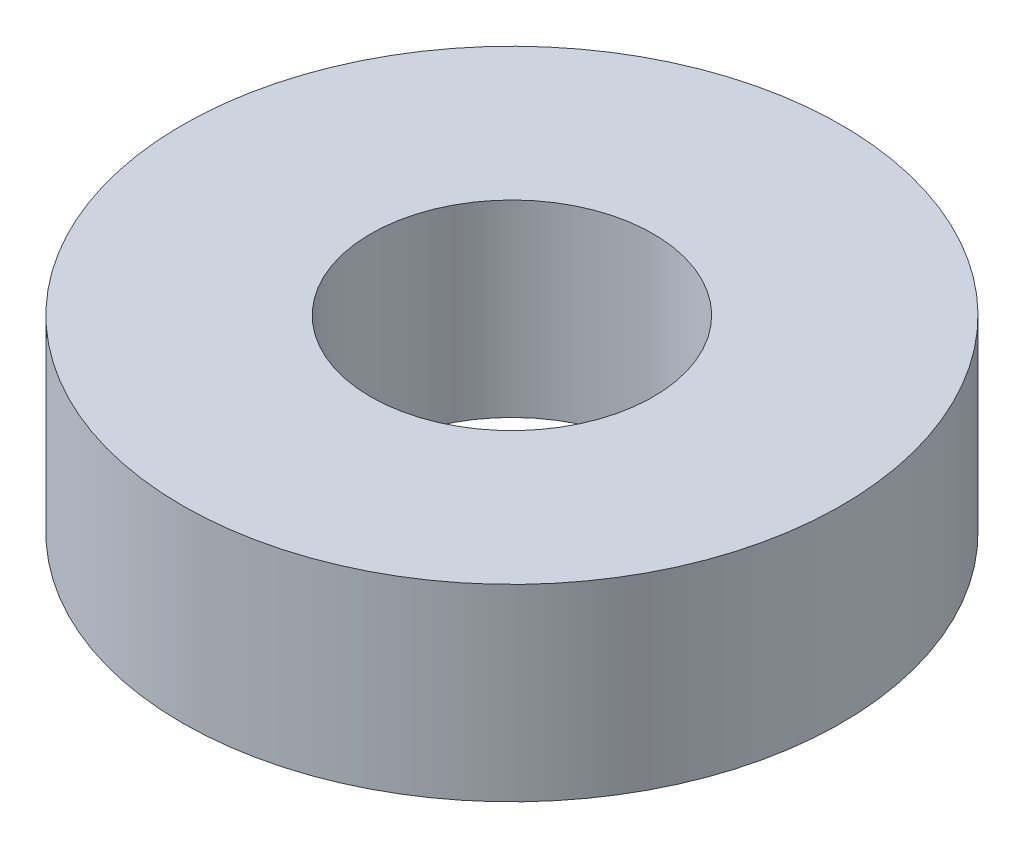
ISO-10303-21;
HEADER;
FILE_DESCRIPTION(('STEP AP214'),'2;1');
FILE_NAME('part.step','',(''),(''),'','','');
FILE_SCHEMA(('AUTOMOTIVE_DESIGN { 1 0 10303 214 1 1 1 1 }'));
ENDSEC;
DATA;
#1=APPLICATION_CONTEXT('core data for automotive mechanical design processes');
#2=APPLICATION_PROTOCOL_DEFINITION('international standard','automotive_design',2000,#1);
#3=PRODUCT_CONTEXT('',#1,'mechanical');
#4=PRODUCT('Part','Part','',(#3));
#5=PRODUCT_RELATED_PRODUCT_CATEGORY('part','',(#4));
#6=PRODUCT_DEFINITION_FORMATION('','',#4);
#7=PRODUCT_DEFINITION_CONTEXT('part definition',#1,'design');
#8=PRODUCT_DEFINITION('design','',#6,#7);
#9=PRODUCT_DEFINITION_SHAPE('','',#8);
#10=(LENGTH_UNIT() NAMED_UNIT(*) SI_UNIT(.MILLI.,.METRE.));
#11=(NAMED_UNIT(*) PLANE_ANGLE_UNIT() SI_UNIT($,.RADIAN.));
#12=(NAMED_UNIT(*) SI_UNIT($,.STERADIAN.) SOLID_ANGLE_UNIT());
#13=UNCERTAINTY_MEASURE_WITH_UNIT(LENGTH_MEASURE(1.E-05),#10,'distance_accuracy_value','');
#14=(GEOMETRIC_REPRESENTATION_CONTEXT(3) GLOBAL_UNCERTAINTY_ASSIGNED_CONTEXT((#13)) GLOBAL_UNIT_ASSIGNED_CONTEXT((#10,
#11,#12)) REPRESENTATION_CONTEXT('',''));
#15=CARTESIAN_POINT('',(0.,0.,0.));
#16=DIRECTION('',(0.,0.,1.));
#17=DIRECTION('',(1.,0.,0.));
#18=AXIS2_PLACEMENT_3D('',#15,#16,#17);
#19=CARTESIAN_POINT('',(0.,30.,0.));
#20=DIRECTION('',(0.,-1.,0.));
#21=DIRECTION('',(0.,0.,-1.));
#22=AXIS2_PLACEMENT_3D('',#19,#20,#21);
#23=CYLINDRICAL_SURFACE('',#22,52.5);
#24=CARTESIAN_POINT('',(0.,30.,0.));
#25=DIRECTION('',(0.,1.,0.));
#26=DIRECTION('',(0.,0.,1.));
#27=AXIS2_PLACEMENT_3D('',#24,#25,#26);
#28=CIRCLE('',#27,52.5);
#29=CARTESIAN_POINT('',(0.,30.,52.5));
#30=VERTEX_POINT('',#29);
#31=EDGE_CURVE('E10',#30,#30,#28,.T.);
#32=ORIENTED_EDGE('',*,*,#31,.F.);
#33=EDGE_LOOP('',(#32));
#34=FACE_BOUND('',#33,.T.);
#35=CARTESIAN_POINT('',(0.,0.,0.));
#36=DIRECTION('',(0.,1.,0.));
#37=DIRECTION('',(0.,0.,1.));
#38=AXIS2_PLACEMENT_3D('',#35,#36,#37);
#39=CIRCLE('',#38,52.5);
#40=CARTESIAN_POINT('',(0.,0.,52.5));
#41=VERTEX_POINT('',#40);
#42=EDGE_CURVE('E37',#41,#41,#39,.T.);
#43=ORIENTED_EDGE('',*,*,#42,.T.);
#44=EDGE_LOOP('',(#43));
#45=FACE_BOUND('',#44,.T.);
#46=ADVANCED_FACE('F40',(#34,#45),#23,.T.);
#47=CARTESIAN_POINT('',(0.,30.,0.));
#48=DIRECTION('',(0.,1.,0.));
#49=DIRECTION('',(0.,0.,1.));
#50=AXIS2_PLACEMENT_3D('',#47,#48,#49);
#51=PLANE('',#50);
#52=CARTESIAN_POINT('',(0.,30.,0.));
#53=DIRECTION('',(0.,1.,0.));
#54=DIRECTION('',(0.,0.,1.));
#55=AXIS2_PLACEMENT_3D('',#52,#53,#54);
#56=CIRCLE('',#55,22.5);
#57=CARTESIAN_POINT('',(0.,30.,22.5));
#58=VERTEX_POINT('',#57);
#59=EDGE_CURVE('E50',#58,#58,#56,.T.);
#60=ORIENTED_EDGE('',*,*,#59,.F.);
#61=EDGE_LOOP('',(#60));
#62=FACE_BOUND('',#61,.T.);
#63=ORIENTED_EDGE('',*,*,#31,.T.);
#64=EDGE_LOOP('',(#63));
#65=FACE_BOUND('',#64,.T.);
#66=ADVANCED_FACE('F59',(#62,#65),#51,.T.);
#67=CARTESIAN_POINT('',(0.,0.,0.));
#68=DIRECTION('',(0.,1.,0.));
#69=DIRECTION('',(0.,0.,1.));
#70=AXIS2_PLACEMENT_3D('',#67,#68,#69);
#71=PLANE('',#70);
#72=CARTESIAN_POINT('',(0.,0.,0.));
#73=DIRECTION('',(0.,1.,0.));
#74=DIRECTION('',(0.,0.,1.));
#75=AXIS2_PLACEMENT_3D('',#72,#73,#74);
#76=CIRCLE('',#75,22.5);
#77=CARTESIAN_POINT('',(0.,0.,22.5));
#78=VERTEX_POINT('',#77);
#79=EDGE_CURVE('E47',#78,#78,#76,.T.);
#80=ORIENTED_EDGE('',*,*,#79,.T.);
#81=EDGE_LOOP('',(#80));
#82=FACE_BOUND('',#81,.T.);
#83=ORIENTED_EDGE('',*,*,#42,.F.);
#84=EDGE_LOOP('',(#83));
#85=FACE_BOUND('',#84,.T.);
#86=ADVANCED_FACE('F58',(#82,#85),#71,.F.);
#87=CARTESIAN_POINT('',(0.,30.,0.));
#88=DIRECTION('',(0.,-1.,0.));
#89=DIRECTION('',(0.,0.,-1.));
#90=AXIS2_PLACEMENT_3D('',#87,#88,#89);
#91=CYLINDRICAL_SURFACE('',#90,22.5);
#92=ORIENTED_EDGE('',*,*,#59,.T.);
#93=EDGE_LOOP('',(#92));
#94=FACE_BOUND('',#93,.T.);
#95=ORIENTED_EDGE('',*,*,#79,.F.);
#96=EDGE_LOOP('',(#95));
#97=FACE_BOUND('',#96,.T.);
#98=ADVANCED_FACE('F54',(#94,#97),#91,.F.);
#99=CLOSED_SHELL('',(#46,#66,#86,#98));
#100=MANIFOLD_SOLID_BREP('B2',#99);
#101=ADVANCED_BREP_SHAPE_REPRESENTATION('',(#18,#100),#14);
#102=SHAPE_DEFINITION_REPRESENTATION(#9,#101);
ENDSEC;
END-ISO-10303-21;
